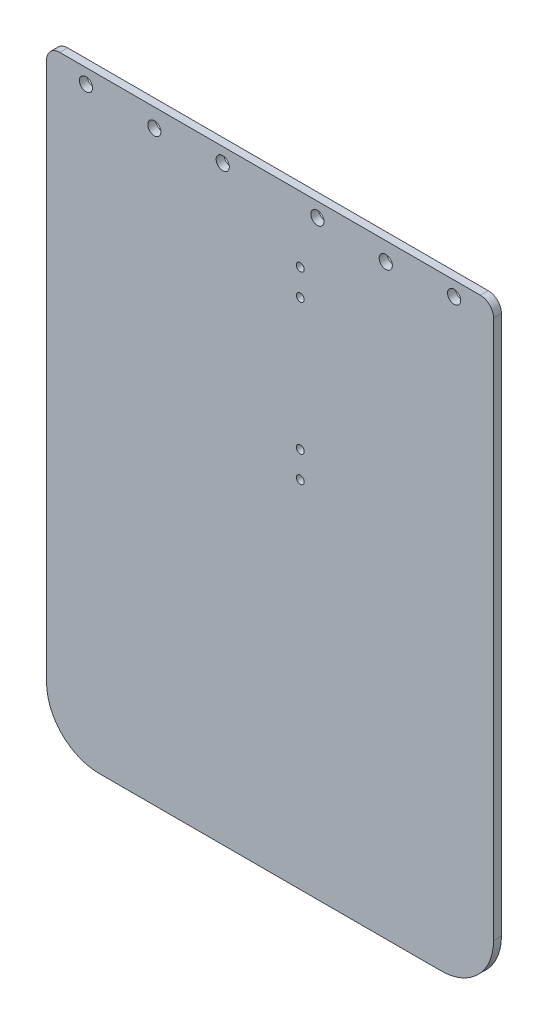
ISO-10303-21;
HEADER;
FILE_DESCRIPTION(('STEP AP214'),'2;1');
FILE_NAME('part.step','',(''),(''),'','','');
FILE_SCHEMA(('AUTOMOTIVE_DESIGN { 1 0 10303 214 1 1 1 1 }'));
ENDSEC;
DATA;
#1=APPLICATION_CONTEXT('core data for automotive mechanical design processes');
#2=APPLICATION_PROTOCOL_DEFINITION('international standard','automotive_design',2000,#1);
#3=PRODUCT_CONTEXT('',#1,'mechanical');
#4=PRODUCT('Part','Part','',(#3));
#5=PRODUCT_RELATED_PRODUCT_CATEGORY('part','',(#4));
#6=PRODUCT_DEFINITION_FORMATION('','',#4);
#7=PRODUCT_DEFINITION_CONTEXT('part definition',#1,'design');
#8=PRODUCT_DEFINITION('design','',#6,#7);
#9=PRODUCT_DEFINITION_SHAPE('','',#8);
#10=(LENGTH_UNIT() NAMED_UNIT(*) SI_UNIT(.MILLI.,.METRE.));
#11=(NAMED_UNIT(*) PLANE_ANGLE_UNIT() SI_UNIT($,.RADIAN.));
#12=(NAMED_UNIT(*) SI_UNIT($,.STERADIAN.) SOLID_ANGLE_UNIT());
#13=UNCERTAINTY_MEASURE_WITH_UNIT(LENGTH_MEASURE(1.E-05),#10,'distance_accuracy_value','');
#14=(GEOMETRIC_REPRESENTATION_CONTEXT(3) GLOBAL_UNCERTAINTY_ASSIGNED_CONTEXT((#13)) GLOBAL_UNIT_ASSIGNED_CONTEXT((#10,
#11,#12)) REPRESENTATION_CONTEXT('',''));
#15=CARTESIAN_POINT('',(0.,0.,0.));
#16=DIRECTION('',(0.,0.,1.));
#17=DIRECTION('',(1.,0.,0.));
#18=AXIS2_PLACEMENT_3D('',#15,#16,#17);
#19=CARTESIAN_POINT('',(85.,100.,3.));
#20=DIRECTION('',(-1.,0.,0.));
#21=DIRECTION('',(0.,-1.,0.));
#22=AXIS2_PLACEMENT_3D('',#19,#20,#21);
#23=PLANE('',#22);
#24=DIRECTION('',(0.,1.,0.));
#25=VECTOR('',#24,1.);
#26=CARTESIAN_POINT('',(85.,100.,0.));
#27=LINE('',#26,#25);
#28=CARTESIAN_POINT('',(85.,-110.,0.));
#29=VERTEX_POINT('',#28);
#30=CARTESIAN_POINT('',(85.,95.,0.));
#31=VERTEX_POINT('',#30);
#32=EDGE_CURVE('E118',#29,#31,#27,.T.);
#33=ORIENTED_EDGE('',*,*,#32,.T.);
#34=DIRECTION('',(0.,0.,-1.));
#35=VECTOR('',#34,1.);
#36=CARTESIAN_POINT('',(85.,95.,3.));
#37=LINE('',#36,#35);
#38=CARTESIAN_POINT('',(85.,95.,3.));
#39=VERTEX_POINT('',#38);
#40=EDGE_CURVE('E60',#31,#39,#37,.F.);
#41=ORIENTED_EDGE('',*,*,#40,.T.);
#42=DIRECTION('',(0.,1.,0.));
#43=VECTOR('',#42,1.);
#44=CARTESIAN_POINT('',(85.,100.,3.));
#45=LINE('',#44,#43);
#46=CARTESIAN_POINT('',(85.,-110.,3.));
#47=VERTEX_POINT('',#46);
#48=EDGE_CURVE('E119',#47,#39,#45,.T.);
#49=ORIENTED_EDGE('',*,*,#48,.F.);
#50=DIRECTION('',(0.,0.,-1.));
#51=VECTOR('',#50,1.);
#52=CARTESIAN_POINT('',(85.,-110.,0.));
#53=LINE('',#52,#51);
#54=EDGE_CURVE('E109',#47,#29,#53,.T.);
#55=ORIENTED_EDGE('',*,*,#54,.T.);
#56=EDGE_LOOP('',(#33,#41,#49,#55));
#57=FACE_BOUND('',#56,.T.);
#58=ADVANCED_FACE('F37',(#57),#23,.F.);
#59=CARTESIAN_POINT('',(-85.,100.,3.));
#60=DIRECTION('',(0.,-1.,0.));
#61=DIRECTION('',(0.,0.,-1.));
#62=AXIS2_PLACEMENT_3D('',#59,#60,#61);
#63=PLANE('',#62);
#64=DIRECTION('',(-1.,0.,0.));
#65=VECTOR('',#64,1.);
#66=CARTESIAN_POINT('',(-85.,100.,3.));
#67=LINE('',#66,#65);
#68=CARTESIAN_POINT('',(80.,100.,3.));
#69=VERTEX_POINT('',#68);
#70=CARTESIAN_POINT('',(-80.,100.,3.));
#71=VERTEX_POINT('',#70);
#72=EDGE_CURVE('E162',#69,#71,#67,.T.);
#73=ORIENTED_EDGE('',*,*,#72,.F.);
#74=DIRECTION('',(0.,0.,-1.));
#75=VECTOR('',#74,1.);
#76=CARTESIAN_POINT('',(80.,100.,3.));
#77=LINE('',#76,#75);
#78=CARTESIAN_POINT('',(80.,100.,0.));
#79=VERTEX_POINT('',#78);
#80=EDGE_CURVE('E152',#69,#79,#77,.T.);
#81=ORIENTED_EDGE('',*,*,#80,.T.);
#82=DIRECTION('',(-1.,0.,0.));
#83=VECTOR('',#82,1.);
#84=CARTESIAN_POINT('',(-85.,100.,0.));
#85=LINE('',#84,#83);
#86=CARTESIAN_POINT('',(-80.,100.,0.));
#87=VERTEX_POINT('',#86);
#88=EDGE_CURVE('E125',#79,#87,#85,.T.);
#89=ORIENTED_EDGE('',*,*,#88,.T.);
#90=DIRECTION('',(0.,0.,-1.));
#91=VECTOR('',#90,1.);
#92=CARTESIAN_POINT('',(-80.,100.,3.));
#93=LINE('',#92,#91);
#94=EDGE_CURVE('E150',#87,#71,#93,.F.);
#95=ORIENTED_EDGE('',*,*,#94,.T.);
#96=EDGE_LOOP('',(#73,#81,#89,#95));
#97=FACE_BOUND('',#96,.T.);
#98=ADVANCED_FACE('F166',(#97),#63,.F.);
#99=CARTESIAN_POINT('',(-85.,100.,3.));
#100=DIRECTION('',(1.,0.,0.));
#101=DIRECTION('',(0.,1.,0.));
#102=AXIS2_PLACEMENT_3D('',#99,#100,#101);
#103=PLANE('',#102);
#104=DIRECTION('',(0.,-1.,0.));
#105=VECTOR('',#104,1.);
#106=CARTESIAN_POINT('',(-85.,100.,3.));
#107=LINE('',#106,#105);
#108=CARTESIAN_POINT('',(-85.,95.,3.));
#109=VERTEX_POINT('',#108);
#110=CARTESIAN_POINT('',(-85.,-110.,3.));
#111=VERTEX_POINT('',#110);
#112=EDGE_CURVE('E120',#109,#111,#107,.T.);
#113=ORIENTED_EDGE('',*,*,#112,.F.);
#114=DIRECTION('',(0.,0.,-1.));
#115=VECTOR('',#114,1.);
#116=CARTESIAN_POINT('',(-85.,95.,3.));
#117=LINE('',#116,#115);
#118=CARTESIAN_POINT('',(-85.,95.,0.));
#119=VERTEX_POINT('',#118);
#120=EDGE_CURVE('E11',#109,#119,#117,.T.);
#121=ORIENTED_EDGE('',*,*,#120,.T.);
#122=DIRECTION('',(0.,-1.,0.));
#123=VECTOR('',#122,1.);
#124=CARTESIAN_POINT('',(-85.,100.,0.));
#125=LINE('',#124,#123);
#126=CARTESIAN_POINT('',(-85.,-110.,0.));
#127=VERTEX_POINT('',#126);
#128=EDGE_CURVE('E129',#119,#127,#125,.T.);
#129=ORIENTED_EDGE('',*,*,#128,.T.);
#130=DIRECTION('',(0.,0.,-1.));
#131=VECTOR('',#130,1.);
#132=CARTESIAN_POINT('',(-85.,-110.,3.));
#133=LINE('',#132,#131);
#134=EDGE_CURVE('E147',#127,#111,#133,.F.);
#135=ORIENTED_EDGE('',*,*,#134,.T.);
#136=EDGE_LOOP('',(#113,#121,#129,#135));
#137=FACE_BOUND('',#136,.T.);
#138=ADVANCED_FACE('F184',(#137),#103,.F.);
#139=CARTESIAN_POINT('',(0.,0.,3.));
#140=DIRECTION('',(0.,0.,1.));
#141=DIRECTION('',(1.,0.,0.));
#142=AXIS2_PLACEMENT_3D('',#139,#140,#141);
#143=PLANE('',#142);
#144=CARTESIAN_POINT('',(70.,94.5,3.));
#145=DIRECTION('',(0.,0.,1.));
#146=DIRECTION('',(1.,0.,0.));
#147=AXIS2_PLACEMENT_3D('',#144,#145,#146);
#148=CIRCLE('',#147,2.5);
#149=CARTESIAN_POINT('',(72.5,94.5,3.));
#150=VERTEX_POINT('',#149);
#151=EDGE_CURVE('E229',#150,#150,#148,.T.);
#152=ORIENTED_EDGE('',*,*,#151,.F.);
#153=EDGE_LOOP('',(#152));
#154=FACE_BOUND('',#153,.T.);
#155=CARTESIAN_POINT('',(44.,93.,3.));
#156=DIRECTION('',(0.,0.,1.));
#157=DIRECTION('',(1.,0.,0.));
#158=AXIS2_PLACEMENT_3D('',#155,#156,#157);
#159=CIRCLE('',#158,2.5);
#160=CARTESIAN_POINT('',(46.5,93.,3.));
#161=VERTEX_POINT('',#160);
#162=EDGE_CURVE('E245',#161,#161,#159,.T.);
#163=ORIENTED_EDGE('',*,*,#162,.F.);
#164=EDGE_LOOP('',(#163));
#165=FACE_BOUND('',#164,.T.);
#166=CARTESIAN_POINT('',(-70.,94.4999999999999,3.));
#167=DIRECTION('',(0.,0.,1.));
#168=DIRECTION('',(1.,0.,0.));
#169=AXIS2_PLACEMENT_3D('',#166,#167,#168);
#170=CIRCLE('',#169,2.5);
#171=CARTESIAN_POINT('',(-67.5,94.4999999999999,3.));
#172=VERTEX_POINT('',#171);
#173=EDGE_CURVE('E248',#172,#172,#170,.T.);
#174=ORIENTED_EDGE('',*,*,#173,.F.);
#175=EDGE_LOOP('',(#174));
#176=FACE_BOUND('',#175,.T.);
#177=CARTESIAN_POINT('',(-44.,92.9999999999999,3.));
#178=DIRECTION('',(0.,0.,1.));
#179=DIRECTION('',(1.,0.,0.));
#180=AXIS2_PLACEMENT_3D('',#177,#178,#179);
#181=CIRCLE('',#180,2.5);
#182=CARTESIAN_POINT('',(-41.5,92.9999999999999,3.));
#183=VERTEX_POINT('',#182);
#184=EDGE_CURVE('E251',#183,#183,#181,.T.);
#185=ORIENTED_EDGE('',*,*,#184,.F.);
#186=EDGE_LOOP('',(#185));
#187=FACE_BOUND('',#186,.T.);
#188=CARTESIAN_POINT('',(-18.,94.4999999999999,3.));
#189=DIRECTION('',(0.,0.,1.));
#190=DIRECTION('',(1.,0.,0.));
#191=AXIS2_PLACEMENT_3D('',#188,#189,#190);
#192=CIRCLE('',#191,2.5);
#193=CARTESIAN_POINT('',(-15.5,94.4999999999999,3.));
#194=VERTEX_POINT('',#193);
#195=EDGE_CURVE('E254',#194,#194,#192,.T.);
#196=ORIENTED_EDGE('',*,*,#195,.F.);
#197=EDGE_LOOP('',(#196));
#198=FACE_BOUND('',#197,.T.);
#199=CARTESIAN_POINT('',(18.,94.5,3.));
#200=DIRECTION('',(0.,0.,1.));
#201=DIRECTION('',(1.,0.,0.));
#202=AXIS2_PLACEMENT_3D('',#199,#200,#201);
#203=CIRCLE('',#202,2.5);
#204=CARTESIAN_POINT('',(20.5,94.5,3.));
#205=VERTEX_POINT('',#204);
#206=EDGE_CURVE('E257',#205,#205,#203,.T.);
#207=ORIENTED_EDGE('',*,*,#206,.F.);
#208=EDGE_LOOP('',(#207));
#209=FACE_BOUND('',#208,.T.);
#210=CARTESIAN_POINT('',(11.4999999999921,15.,3.));
#211=DIRECTION('',(0.,0.,1.));
#212=DIRECTION('',(1.,0.,0.));
#213=AXIS2_PLACEMENT_3D('',#210,#211,#212);
#214=CIRCLE('',#213,1.5);
#215=CARTESIAN_POINT('',(12.9999999999921,15.,3.));
#216=VERTEX_POINT('',#215);
#217=EDGE_CURVE('E238',#216,#216,#214,.T.);
#218=ORIENTED_EDGE('',*,*,#217,.F.);
#219=EDGE_LOOP('',(#218));
#220=FACE_BOUND('',#219,.T.);
#221=CARTESIAN_POINT('',(11.4999999999937,64.9999999999999,3.));
#222=DIRECTION('',(0.,0.,1.));
#223=DIRECTION('',(1.,0.,0.));
#224=AXIS2_PLACEMENT_3D('',#221,#222,#223);
#225=CIRCLE('',#224,1.5);
#226=CARTESIAN_POINT('',(12.9999999999937,64.9999999999999,3.));
#227=VERTEX_POINT('',#226);
#228=EDGE_CURVE('E232',#227,#227,#225,.T.);
#229=ORIENTED_EDGE('',*,*,#228,.F.);
#230=EDGE_LOOP('',(#229));
#231=FACE_BOUND('',#230,.T.);
#232=CARTESIAN_POINT('',(11.4999999999937,75.,3.));
#233=DIRECTION('',(0.,0.,1.));
#234=DIRECTION('',(1.,0.,0.));
#235=AXIS2_PLACEMENT_3D('',#232,#233,#234);
#236=CIRCLE('',#235,1.5);
#237=CARTESIAN_POINT('',(12.9999999999937,75.,3.));
#238=VERTEX_POINT('',#237);
#239=EDGE_CURVE('E225',#238,#238,#236,.T.);
#240=ORIENTED_EDGE('',*,*,#239,.F.);
#241=EDGE_LOOP('',(#240));
#242=FACE_BOUND('',#241,.T.);
#243=CARTESIAN_POINT('',(11.4999999999921,4.99999999999995,3.));
#244=DIRECTION('',(0.,0.,1.));
#245=DIRECTION('',(1.,0.,0.));
#246=AXIS2_PLACEMENT_3D('',#243,#244,#245);
#247=CIRCLE('',#246,1.5);
#248=CARTESIAN_POINT('',(12.9999999999921,4.99999999999995,3.));
#249=VERTEX_POINT('',#248);
#250=EDGE_CURVE('E218',#249,#249,#247,.T.);
#251=ORIENTED_EDGE('',*,*,#250,.F.);
#252=EDGE_LOOP('',(#251));
#253=FACE_BOUND('',#252,.T.);
#254=ORIENTED_EDGE('',*,*,#48,.T.);
#255=CARTESIAN_POINT('',(80.,95.,3.));
#256=DIRECTION('',(0.,0.,1.));
#257=DIRECTION('',(1.,0.,0.));
#258=AXIS2_PLACEMENT_3D('',#255,#256,#257);
#259=CIRCLE('',#258,5.);
#260=EDGE_CURVE('E45',#39,#69,#259,.T.);
#261=ORIENTED_EDGE('',*,*,#260,.T.);
#262=ORIENTED_EDGE('',*,*,#72,.T.);
#263=CARTESIAN_POINT('',(-80.,95.,3.));
#264=DIRECTION('',(0.,0.,1.));
#265=DIRECTION('',(1.,0.,0.));
#266=AXIS2_PLACEMENT_3D('',#263,#264,#265);
#267=CIRCLE('',#266,5.);
#268=EDGE_CURVE('E52',#71,#109,#267,.T.);
#269=ORIENTED_EDGE('',*,*,#268,.T.);
#270=ORIENTED_EDGE('',*,*,#112,.T.);
#271=CARTESIAN_POINT('',(-65.,-110.,3.));
#272=DIRECTION('',(0.,0.,1.));
#273=DIRECTION('',(1.,0.,0.));
#274=AXIS2_PLACEMENT_3D('',#271,#272,#273);
#275=CIRCLE('',#274,20.);
#276=CARTESIAN_POINT('',(-65.,-130.,3.));
#277=VERTEX_POINT('',#276);
#278=EDGE_CURVE('E143',#111,#277,#275,.T.);
#279=ORIENTED_EDGE('',*,*,#278,.T.);
#280=DIRECTION('',(-1.,0.,0.));
#281=VECTOR('',#280,1.);
#282=CARTESIAN_POINT('',(85.,-130.,3.));
#283=LINE('',#282,#281);
#284=CARTESIAN_POINT('',(65.,-130.,3.));
#285=VERTEX_POINT('',#284);
#286=EDGE_CURVE('E126',#285,#277,#283,.T.);
#287=ORIENTED_EDGE('',*,*,#286,.F.);
#288=CARTESIAN_POINT('',(65.,-110.,3.));
#289=DIRECTION('',(0.,0.,1.));
#290=DIRECTION('',(1.,0.,0.));
#291=AXIS2_PLACEMENT_3D('',#288,#289,#290);
#292=CIRCLE('',#291,20.);
#293=EDGE_CURVE('E145',#285,#47,#292,.T.);
#294=ORIENTED_EDGE('',*,*,#293,.T.);
#295=EDGE_LOOP('',(#254,#261,#262,#269,#270,#279,#287,#294));
#296=FACE_BOUND('',#295,.T.);
#297=ADVANCED_FACE('F161',(#154,#165,#176,#187,#198,#209,#220,#231,#242,#253,#296),#143,.T.);
#298=CARTESIAN_POINT('',(0.,0.,0.));
#299=DIRECTION('',(0.,0.,1.));
#300=DIRECTION('',(1.,0.,0.));
#301=AXIS2_PLACEMENT_3D('',#298,#299,#300);
#302=PLANE('',#301);
#303=CARTESIAN_POINT('',(70.,94.5,0.));
#304=DIRECTION('',(0.,0.,-1.));
#305=DIRECTION('',(-1.,0.,0.));
#306=AXIS2_PLACEMENT_3D('',#303,#304,#305);
#307=CIRCLE('',#306,2.5);
#308=CARTESIAN_POINT('',(67.5,94.5,0.));
#309=VERTEX_POINT('',#308);
#310=EDGE_CURVE('E263',#309,#309,#307,.T.);
#311=ORIENTED_EDGE('',*,*,#310,.F.);
#312=EDGE_LOOP('',(#311));
#313=FACE_BOUND('',#312,.T.);
#314=CARTESIAN_POINT('',(44.,93.,0.));
#315=DIRECTION('',(0.,0.,-1.));
#316=DIRECTION('',(-1.,0.,0.));
#317=AXIS2_PLACEMENT_3D('',#314,#315,#316);
#318=CIRCLE('',#317,2.5);
#319=CARTESIAN_POINT('',(41.5,93.,0.));
#320=VERTEX_POINT('',#319);
#321=EDGE_CURVE('E271',#320,#320,#318,.T.);
#322=ORIENTED_EDGE('',*,*,#321,.F.);
#323=EDGE_LOOP('',(#322));
#324=FACE_BOUND('',#323,.T.);
#325=CARTESIAN_POINT('',(-70.,94.4999999999999,0.));
#326=DIRECTION('',(0.,0.,-1.));
#327=DIRECTION('',(1.,0.,0.));
#328=AXIS2_PLACEMENT_3D('',#325,#326,#327);
#329=CIRCLE('',#328,2.5);
#330=CARTESIAN_POINT('',(-67.5,94.4999999999999,0.));
#331=VERTEX_POINT('',#330);
#332=EDGE_CURVE('E267',#331,#331,#329,.T.);
#333=ORIENTED_EDGE('',*,*,#332,.F.);
#334=EDGE_LOOP('',(#333));
#335=FACE_BOUND('',#334,.T.);
#336=CARTESIAN_POINT('',(-44.,92.9999999999999,0.));
#337=DIRECTION('',(0.,0.,-1.));
#338=DIRECTION('',(1.,0.,0.));
#339=AXIS2_PLACEMENT_3D('',#336,#337,#338);
#340=CIRCLE('',#339,2.5);
#341=CARTESIAN_POINT('',(-41.5,92.9999999999999,0.));
#342=VERTEX_POINT('',#341);
#343=EDGE_CURVE('E264',#342,#342,#340,.T.);
#344=ORIENTED_EDGE('',*,*,#343,.F.);
#345=EDGE_LOOP('',(#344));
#346=FACE_BOUND('',#345,.T.);
#347=CARTESIAN_POINT('',(-18.,94.4999999999999,0.));
#348=DIRECTION('',(0.,0.,-1.));
#349=DIRECTION('',(1.,0.,0.));
#350=AXIS2_PLACEMENT_3D('',#347,#348,#349);
#351=CIRCLE('',#350,2.5);
#352=CARTESIAN_POINT('',(-15.5,94.4999999999999,0.));
#353=VERTEX_POINT('',#352);
#354=EDGE_CURVE('E268',#353,#353,#351,.T.);
#355=ORIENTED_EDGE('',*,*,#354,.F.);
#356=EDGE_LOOP('',(#355));
#357=FACE_BOUND('',#356,.T.);
#358=CARTESIAN_POINT('',(18.,94.5,0.));
#359=DIRECTION('',(0.,0.,-1.));
#360=DIRECTION('',(-1.,0.,0.));
#361=AXIS2_PLACEMENT_3D('',#358,#359,#360);
#362=CIRCLE('',#361,2.5);
#363=CARTESIAN_POINT('',(15.5,94.5,0.));
#364=VERTEX_POINT('',#363);
#365=EDGE_CURVE('E260',#364,#364,#362,.T.);
#366=ORIENTED_EDGE('',*,*,#365,.F.);
#367=EDGE_LOOP('',(#366));
#368=FACE_BOUND('',#367,.T.);
#369=CARTESIAN_POINT('',(11.4999999999921,15.,0.));
#370=DIRECTION('',(0.,0.,1.));
#371=DIRECTION('',(1.,0.,0.));
#372=AXIS2_PLACEMENT_3D('',#369,#370,#371);
#373=CIRCLE('',#372,1.5);
#374=CARTESIAN_POINT('',(12.9999999999921,15.,0.));
#375=VERTEX_POINT('',#374);
#376=EDGE_CURVE('E223',#375,#375,#373,.T.);
#377=ORIENTED_EDGE('',*,*,#376,.T.);
#378=EDGE_LOOP('',(#377));
#379=FACE_BOUND('',#378,.T.);
#380=CARTESIAN_POINT('',(11.4999999999937,64.9999999999999,0.));
#381=DIRECTION('',(0.,0.,1.));
#382=DIRECTION('',(1.,0.,0.));
#383=AXIS2_PLACEMENT_3D('',#380,#381,#382);
#384=CIRCLE('',#383,1.5);
#385=CARTESIAN_POINT('',(12.9999999999937,64.9999999999999,0.));
#386=VERTEX_POINT('',#385);
#387=EDGE_CURVE('E235',#386,#386,#384,.T.);
#388=ORIENTED_EDGE('',*,*,#387,.T.);
#389=EDGE_LOOP('',(#388));
#390=FACE_BOUND('',#389,.T.);
#391=CARTESIAN_POINT('',(11.4999999999937,75.,0.));
#392=DIRECTION('',(0.,0.,1.));
#393=DIRECTION('',(1.,0.,0.));
#394=AXIS2_PLACEMENT_3D('',#391,#392,#393);
#395=CIRCLE('',#394,1.5);
#396=CARTESIAN_POINT('',(12.9999999999937,75.,0.));
#397=VERTEX_POINT('',#396);
#398=EDGE_CURVE('E228',#397,#397,#395,.T.);
#399=ORIENTED_EDGE('',*,*,#398,.T.);
#400=EDGE_LOOP('',(#399));
#401=FACE_BOUND('',#400,.T.);
#402=CARTESIAN_POINT('',(11.4999999999921,4.99999999999995,0.));
#403=DIRECTION('',(0.,0.,1.));
#404=DIRECTION('',(1.,0.,0.));
#405=AXIS2_PLACEMENT_3D('',#402,#403,#404);
#406=CIRCLE('',#405,1.5);
#407=CARTESIAN_POINT('',(12.9999999999921,4.99999999999995,0.));
#408=VERTEX_POINT('',#407);
#409=EDGE_CURVE('E215',#408,#408,#406,.T.);
#410=ORIENTED_EDGE('',*,*,#409,.T.);
#411=EDGE_LOOP('',(#410));
#412=FACE_BOUND('',#411,.T.);
#413=ORIENTED_EDGE('',*,*,#88,.F.);
#414=CARTESIAN_POINT('',(80.,95.,0.));
#415=DIRECTION('',(0.,0.,1.));
#416=DIRECTION('',(1.,0.,0.));
#417=AXIS2_PLACEMENT_3D('',#414,#415,#416);
#418=CIRCLE('',#417,5.);
#419=EDGE_CURVE('E124',#79,#31,#418,.F.);
#420=ORIENTED_EDGE('',*,*,#419,.T.);
#421=ORIENTED_EDGE('',*,*,#32,.F.);
#422=CARTESIAN_POINT('',(65.,-110.,0.));
#423=DIRECTION('',(0.,0.,1.));
#424=DIRECTION('',(1.,0.,0.));
#425=AXIS2_PLACEMENT_3D('',#422,#423,#424);
#426=CIRCLE('',#425,20.);
#427=CARTESIAN_POINT('',(65.,-130.,0.));
#428=VERTEX_POINT('',#427);
#429=EDGE_CURVE('E105',#29,#428,#426,.F.);
#430=ORIENTED_EDGE('',*,*,#429,.T.);
#431=DIRECTION('',(-1.,0.,0.));
#432=VECTOR('',#431,1.);
#433=CARTESIAN_POINT('',(85.,-130.,0.));
#434=LINE('',#433,#432);
#435=CARTESIAN_POINT('',(-65.,-130.,0.));
#436=VERTEX_POINT('',#435);
#437=EDGE_CURVE('E132',#428,#436,#434,.T.);
#438=ORIENTED_EDGE('',*,*,#437,.T.);
#439=CARTESIAN_POINT('',(-65.,-110.,0.));
#440=DIRECTION('',(0.,0.,1.));
#441=DIRECTION('',(1.,0.,0.));
#442=AXIS2_PLACEMENT_3D('',#439,#440,#441);
#443=CIRCLE('',#442,20.);
#444=EDGE_CURVE('E116',#436,#127,#443,.F.);
#445=ORIENTED_EDGE('',*,*,#444,.T.);
#446=ORIENTED_EDGE('',*,*,#128,.F.);
#447=CARTESIAN_POINT('',(-80.,95.,0.));
#448=DIRECTION('',(0.,0.,1.));
#449=DIRECTION('',(1.,0.,0.));
#450=AXIS2_PLACEMENT_3D('',#447,#448,#449);
#451=CIRCLE('',#450,5.);
#452=EDGE_CURVE('E155',#119,#87,#451,.F.);
#453=ORIENTED_EDGE('',*,*,#452,.T.);
#454=EDGE_LOOP('',(#413,#420,#421,#430,#438,#445,#446,#453));
#455=FACE_BOUND('',#454,.T.);
#456=ADVANCED_FACE('F123',(#313,#324,#335,#346,#357,#368,#379,#390,#401,#412,#455),#302,.F.);
#457=CARTESIAN_POINT('',(85.,-130.,175.626765016321));
#458=DIRECTION('',(0.,-1.,0.));
#459=DIRECTION('',(0.,0.,-1.));
#460=AXIS2_PLACEMENT_3D('',#457,#458,#459);
#461=PLANE('',#460);
#462=ORIENTED_EDGE('',*,*,#437,.F.);
#463=DIRECTION('',(0.,0.,-1.));
#464=VECTOR('',#463,1.);
#465=CARTESIAN_POINT('',(65.,-130.,3.));
#466=LINE('',#465,#464);
#467=EDGE_CURVE('E110',#428,#285,#466,.F.);
#468=ORIENTED_EDGE('',*,*,#467,.T.);
#469=ORIENTED_EDGE('',*,*,#286,.T.);
#470=DIRECTION('',(0.,0.,-1.));
#471=VECTOR('',#470,1.);
#472=CARTESIAN_POINT('',(-65.,-130.,0.));
#473=LINE('',#472,#471);
#474=EDGE_CURVE('E115',#277,#436,#473,.T.);
#475=ORIENTED_EDGE('',*,*,#474,.T.);
#476=EDGE_LOOP('',(#462,#468,#469,#475));
#477=FACE_BOUND('',#476,.T.);
#478=ADVANCED_FACE('F189',(#477),#461,.T.);
#479=CARTESIAN_POINT('',(65.,-110.,3.));
#480=DIRECTION('',(0.,0.,1.));
#481=DIRECTION('',(1.,0.,0.));
#482=AXIS2_PLACEMENT_3D('',#479,#480,#481);
#483=CYLINDRICAL_SURFACE('',#482,20.);
#484=ORIENTED_EDGE('',*,*,#293,.F.);
#485=ORIENTED_EDGE('',*,*,#467,.F.);
#486=ORIENTED_EDGE('',*,*,#429,.F.);
#487=ORIENTED_EDGE('',*,*,#54,.F.);
#488=EDGE_LOOP('',(#484,#485,#486,#487));
#489=FACE_BOUND('',#488,.T.);
#490=ADVANCED_FACE('F108',(#489),#483,.T.);
#491=CARTESIAN_POINT('',(-65.,-110.,175.626765016321));
#492=DIRECTION('',(0.,0.,1.));
#493=DIRECTION('',(1.,0.,0.));
#494=AXIS2_PLACEMENT_3D('',#491,#492,#493);
#495=CYLINDRICAL_SURFACE('',#494,20.);
#496=ORIENTED_EDGE('',*,*,#278,.F.);
#497=ORIENTED_EDGE('',*,*,#134,.F.);
#498=ORIENTED_EDGE('',*,*,#444,.F.);
#499=ORIENTED_EDGE('',*,*,#474,.F.);
#500=EDGE_LOOP('',(#496,#497,#498,#499));
#501=FACE_BOUND('',#500,.T.);
#502=ADVANCED_FACE('F170',(#501),#495,.T.);
#503=CARTESIAN_POINT('',(80.,95.,3.));
#504=DIRECTION('',(0.,0.,-1.));
#505=DIRECTION('',(-1.,0.,0.));
#506=AXIS2_PLACEMENT_3D('',#503,#504,#505);
#507=CYLINDRICAL_SURFACE('',#506,5.);
#508=ORIENTED_EDGE('',*,*,#260,.F.);
#509=ORIENTED_EDGE('',*,*,#40,.F.);
#510=ORIENTED_EDGE('',*,*,#419,.F.);
#511=ORIENTED_EDGE('',*,*,#80,.F.);
#512=EDGE_LOOP('',(#508,#509,#510,#511));
#513=FACE_BOUND('',#512,.T.);
#514=ADVANCED_FACE('F168',(#513),#507,.T.);
#515=CARTESIAN_POINT('',(-80.,95.,3.));
#516=DIRECTION('',(0.,0.,-1.));
#517=DIRECTION('',(-1.,0.,0.));
#518=AXIS2_PLACEMENT_3D('',#515,#516,#517);
#519=CYLINDRICAL_SURFACE('',#518,5.);
#520=ORIENTED_EDGE('',*,*,#268,.F.);
#521=ORIENTED_EDGE('',*,*,#94,.F.);
#522=ORIENTED_EDGE('',*,*,#452,.F.);
#523=ORIENTED_EDGE('',*,*,#120,.F.);
#524=EDGE_LOOP('',(#520,#521,#522,#523));
#525=FACE_BOUND('',#524,.T.);
#526=ADVANCED_FACE('F39',(#525),#519,.T.);
#527=CARTESIAN_POINT('',(11.4999999999921,4.99999999999995,0.));
#528=DIRECTION('',(0.,0.,1.));
#529=DIRECTION('',(1.,0.,0.));
#530=AXIS2_PLACEMENT_3D('',#527,#528,#529);
#531=CYLINDRICAL_SURFACE('',#530,1.5);
#532=ORIENTED_EDGE('',*,*,#409,.F.);
#533=EDGE_LOOP('',(#532));
#534=FACE_BOUND('',#533,.T.);
#535=ORIENTED_EDGE('',*,*,#250,.T.);
#536=EDGE_LOOP('',(#535));
#537=FACE_BOUND('',#536,.T.);
#538=ADVANCED_FACE('F175',(#534,#537),#531,.F.);
#539=CARTESIAN_POINT('',(11.4999999999937,75.,0.));
#540=DIRECTION('',(0.,0.,1.));
#541=DIRECTION('',(1.,0.,0.));
#542=AXIS2_PLACEMENT_3D('',#539,#540,#541);
#543=CYLINDRICAL_SURFACE('',#542,1.5);
#544=ORIENTED_EDGE('',*,*,#398,.F.);
#545=EDGE_LOOP('',(#544));
#546=FACE_BOUND('',#545,.T.);
#547=ORIENTED_EDGE('',*,*,#239,.T.);
#548=EDGE_LOOP('',(#547));
#549=FACE_BOUND('',#548,.T.);
#550=ADVANCED_FACE('F294',(#546,#549),#543,.F.);
#551=CARTESIAN_POINT('',(11.4999999999937,64.9999999999999,0.));
#552=DIRECTION('',(0.,0.,1.));
#553=DIRECTION('',(1.,0.,0.));
#554=AXIS2_PLACEMENT_3D('',#551,#552,#553);
#555=CYLINDRICAL_SURFACE('',#554,1.5);
#556=ORIENTED_EDGE('',*,*,#387,.F.);
#557=EDGE_LOOP('',(#556));
#558=FACE_BOUND('',#557,.T.);
#559=ORIENTED_EDGE('',*,*,#228,.T.);
#560=EDGE_LOOP('',(#559));
#561=FACE_BOUND('',#560,.T.);
#562=ADVANCED_FACE('F300',(#558,#561),#555,.F.);
#563=CARTESIAN_POINT('',(11.4999999999921,15.,0.));
#564=DIRECTION('',(0.,0.,1.));
#565=DIRECTION('',(1.,0.,0.));
#566=AXIS2_PLACEMENT_3D('',#563,#564,#565);
#567=CYLINDRICAL_SURFACE('',#566,1.5);
#568=ORIENTED_EDGE('',*,*,#376,.F.);
#569=EDGE_LOOP('',(#568));
#570=FACE_BOUND('',#569,.T.);
#571=ORIENTED_EDGE('',*,*,#217,.T.);
#572=EDGE_LOOP('',(#571));
#573=FACE_BOUND('',#572,.T.);
#574=ADVANCED_FACE('F305',(#570,#573),#567,.F.);
#575=CARTESIAN_POINT('',(18.,94.5,10.));
#576=DIRECTION('',(0.,0.,-1.));
#577=DIRECTION('',(-1.,0.,0.));
#578=AXIS2_PLACEMENT_3D('',#575,#576,#577);
#579=CYLINDRICAL_SURFACE('',#578,2.5);
#580=ORIENTED_EDGE('',*,*,#206,.T.);
#581=EDGE_LOOP('',(#580));
#582=FACE_BOUND('',#581,.T.);
#583=ORIENTED_EDGE('',*,*,#365,.T.);
#584=EDGE_LOOP('',(#583));
#585=FACE_BOUND('',#584,.T.);
#586=ADVANCED_FACE('F312',(#582,#585),#579,.F.);
#587=CARTESIAN_POINT('',(-18.,94.4999999999999,10.));
#588=DIRECTION('',(0.,0.,-1.));
#589=DIRECTION('',(-1.,0.,0.));
#590=AXIS2_PLACEMENT_3D('',#587,#588,#589);
#591=CYLINDRICAL_SURFACE('',#590,2.5);
#592=ORIENTED_EDGE('',*,*,#195,.T.);
#593=EDGE_LOOP('',(#592));
#594=FACE_BOUND('',#593,.T.);
#595=ORIENTED_EDGE('',*,*,#354,.T.);
#596=EDGE_LOOP('',(#595));
#597=FACE_BOUND('',#596,.T.);
#598=ADVANCED_FACE('F279',(#594,#597),#591,.F.);
#599=CARTESIAN_POINT('',(-44.,92.9999999999999,10.));
#600=DIRECTION('',(0.,0.,-1.));
#601=DIRECTION('',(-1.,0.,0.));
#602=AXIS2_PLACEMENT_3D('',#599,#600,#601);
#603=CYLINDRICAL_SURFACE('',#602,2.5);
#604=ORIENTED_EDGE('',*,*,#184,.T.);
#605=EDGE_LOOP('',(#604));
#606=FACE_BOUND('',#605,.T.);
#607=ORIENTED_EDGE('',*,*,#343,.T.);
#608=EDGE_LOOP('',(#607));
#609=FACE_BOUND('',#608,.T.);
#610=ADVANCED_FACE('F317',(#606,#609),#603,.F.);
#611=CARTESIAN_POINT('',(-70.,94.4999999999999,10.));
#612=DIRECTION('',(0.,0.,-1.));
#613=DIRECTION('',(-1.,0.,0.));
#614=AXIS2_PLACEMENT_3D('',#611,#612,#613);
#615=CYLINDRICAL_SURFACE('',#614,2.5);
#616=ORIENTED_EDGE('',*,*,#173,.T.);
#617=EDGE_LOOP('',(#616));
#618=FACE_BOUND('',#617,.T.);
#619=ORIENTED_EDGE('',*,*,#332,.T.);
#620=EDGE_LOOP('',(#619));
#621=FACE_BOUND('',#620,.T.);
#622=ADVANCED_FACE('F320',(#618,#621),#615,.F.);
#623=CARTESIAN_POINT('',(44.,93.,10.));
#624=DIRECTION('',(0.,0.,-1.));
#625=DIRECTION('',(-1.,0.,0.));
#626=AXIS2_PLACEMENT_3D('',#623,#624,#625);
#627=CYLINDRICAL_SURFACE('',#626,2.5);
#628=ORIENTED_EDGE('',*,*,#162,.T.);
#629=EDGE_LOOP('',(#628));
#630=FACE_BOUND('',#629,.T.);
#631=ORIENTED_EDGE('',*,*,#321,.T.);
#632=EDGE_LOOP('',(#631));
#633=FACE_BOUND('',#632,.T.);
#634=ADVANCED_FACE('F324',(#630,#633),#627,.F.);
#635=CARTESIAN_POINT('',(70.,94.5,10.));
#636=DIRECTION('',(0.,0.,-1.));
#637=DIRECTION('',(-1.,0.,0.));
#638=AXIS2_PLACEMENT_3D('',#635,#636,#637);
#639=CYLINDRICAL_SURFACE('',#638,2.5);
#640=ORIENTED_EDGE('',*,*,#151,.T.);
#641=EDGE_LOOP('',(#640));
#642=FACE_BOUND('',#641,.T.);
#643=ORIENTED_EDGE('',*,*,#310,.T.);
#644=EDGE_LOOP('',(#643));
#645=FACE_BOUND('',#644,.T.);
#646=ADVANCED_FACE('F328',(#642,#645),#639,.F.);
#647=CLOSED_SHELL('',(#58,#98,#138,#297,#456,#478,#490,#502,#514,#526,#538,#550,#562,#574,#586,
#598,#610,#622,#634,#646));
#648=MANIFOLD_SOLID_BREP('B2',#647);
#649=ADVANCED_BREP_SHAPE_REPRESENTATION('',(#18,#648),#14);
#650=SHAPE_DEFINITION_REPRESENTATION(#9,#649);
ENDSEC;
END-ISO-10303-21;
